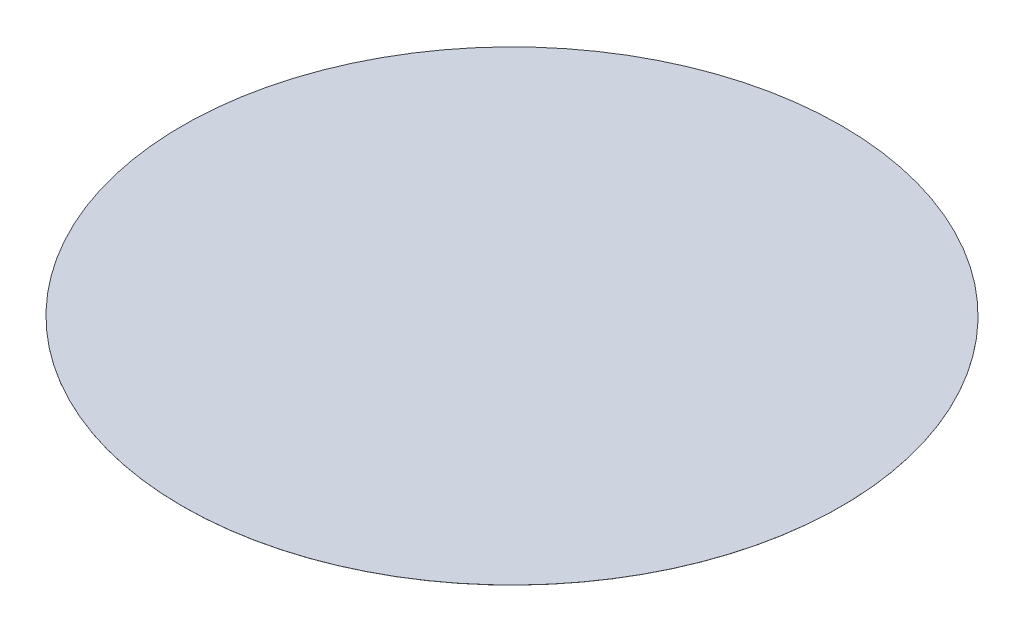
ISO-10303-21;
HEADER;
FILE_DESCRIPTION(('STEP AP214'),'2;1');
FILE_NAME('part.step','',(''),(''),'','','');
FILE_SCHEMA(('AUTOMOTIVE_DESIGN { 1 0 10303 214 1 1 1 1 }'));
ENDSEC;
DATA;
#1=APPLICATION_CONTEXT('core data for automotive mechanical design processes');
#2=APPLICATION_PROTOCOL_DEFINITION('international standard','automotive_design',2000,#1);
#3=PRODUCT_CONTEXT('',#1,'mechanical');
#4=PRODUCT('Part','Part','',(#3));
#5=PRODUCT_RELATED_PRODUCT_CATEGORY('part','',(#4));
#6=PRODUCT_DEFINITION_FORMATION('','',#4);
#7=PRODUCT_DEFINITION_CONTEXT('part definition',#1,'design');
#8=PRODUCT_DEFINITION('design','',#6,#7);
#9=PRODUCT_DEFINITION_SHAPE('','',#8);
#10=(LENGTH_UNIT() NAMED_UNIT(*) SI_UNIT(.MILLI.,.METRE.));
#11=(NAMED_UNIT(*) PLANE_ANGLE_UNIT() SI_UNIT($,.RADIAN.));
#12=(NAMED_UNIT(*) SI_UNIT($,.STERADIAN.) SOLID_ANGLE_UNIT());
#13=UNCERTAINTY_MEASURE_WITH_UNIT(LENGTH_MEASURE(1.E-05),#10,'distance_accuracy_value','');
#14=(GEOMETRIC_REPRESENTATION_CONTEXT(3) GLOBAL_UNCERTAINTY_ASSIGNED_CONTEXT((#13)) GLOBAL_UNIT_ASSIGNED_CONTEXT((#10,
#11,#12)) REPRESENTATION_CONTEXT('',''));
#15=CARTESIAN_POINT('',(0.,0.,0.));
#16=DIRECTION('',(0.,0.,1.));
#17=DIRECTION('',(1.,0.,0.));
#18=AXIS2_PLACEMENT_3D('',#15,#16,#17);
#19=CARTESIAN_POINT('',(0.,0.25,0.));
#20=DIRECTION('',(0.,-1.,0.));
#21=DIRECTION('',(0.,0.,-1.));
#22=AXIS2_PLACEMENT_3D('',#19,#20,#21);
#23=CYLINDRICAL_SURFACE('',#22,1150.);
#24=CARTESIAN_POINT('',(0.,0.,0.));
#25=DIRECTION('',(0.,1.,0.));
#26=DIRECTION('',(0.,0.,1.));
#27=AXIS2_PLACEMENT_3D('',#24,#25,#26);
#28=CIRCLE('',#27,1150.);
#29=CARTESIAN_POINT('',(0.,0.,1150.));
#30=VERTEX_POINT('',#29);
#31=EDGE_CURVE('E34',#30,#30,#28,.T.);
#32=ORIENTED_EDGE('',*,*,#31,.T.);
#33=EDGE_LOOP('',(#32));
#34=FACE_BOUND('',#33,.T.);
#35=CARTESIAN_POINT('',(0.,0.25,0.));
#36=DIRECTION('',(0.,1.,0.));
#37=DIRECTION('',(0.,0.,-1.));
#38=AXIS2_PLACEMENT_3D('',#35,#36,#37);
#39=CIRCLE('',#38,1150.);
#40=CARTESIAN_POINT('',(0.,0.25,-1150.));
#41=VERTEX_POINT('',#40);
#42=EDGE_CURVE('E10',#41,#41,#39,.T.);
#43=ORIENTED_EDGE('',*,*,#42,.F.);
#44=EDGE_LOOP('',(#43));
#45=FACE_BOUND('',#44,.T.);
#46=ADVANCED_FACE('F31',(#34,#45),#23,.T.);
#47=CARTESIAN_POINT('',(0.,0.25,0.));
#48=DIRECTION('',(0.,1.,0.));
#49=DIRECTION('',(0.,0.,1.));
#50=AXIS2_PLACEMENT_3D('',#47,#48,#49);
#51=PLANE('',#50);
#52=ORIENTED_EDGE('',*,*,#42,.T.);
#53=EDGE_LOOP('',(#52));
#54=FACE_BOUND('',#53,.T.);
#55=ADVANCED_FACE('F47',(#54),#51,.T.);
#56=CARTESIAN_POINT('',(0.,0.,0.));
#57=DIRECTION('',(0.,1.,0.));
#58=DIRECTION('',(0.,0.,1.));
#59=AXIS2_PLACEMENT_3D('',#56,#57,#58);
#60=PLANE('',#59);
#61=ORIENTED_EDGE('',*,*,#31,.F.);
#62=EDGE_LOOP('',(#61));
#63=FACE_BOUND('',#62,.T.);
#64=ADVANCED_FACE('F45',(#63),#60,.F.);
#65=CLOSED_SHELL('',(#46,#55,#64));
#66=MANIFOLD_SOLID_BREP('B2',#65);
#67=ADVANCED_BREP_SHAPE_REPRESENTATION('',(#18,#66),#14);
#68=SHAPE_DEFINITION_REPRESENTATION(#9,#67);
ENDSEC;
END-ISO-10303-21;
